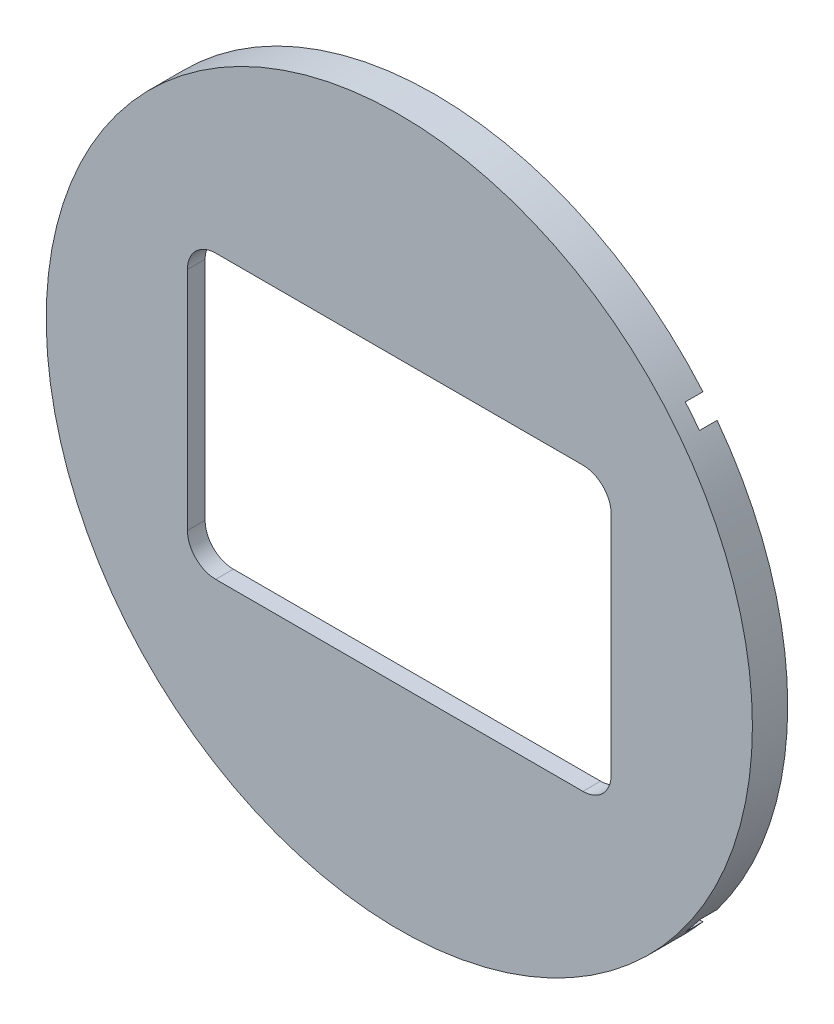
ISO-10303-21;
HEADER;
FILE_DESCRIPTION(('STEP AP214'),'2;1');
FILE_NAME('part.step','',(''),(''),'','','');
FILE_SCHEMA(('AUTOMOTIVE_DESIGN { 1 0 10303 214 1 1 1 1 }'));
ENDSEC;
DATA;
#1=APPLICATION_CONTEXT('core data for automotive mechanical design processes');
#2=APPLICATION_PROTOCOL_DEFINITION('international standard','automotive_design',2000,#1);
#3=PRODUCT_CONTEXT('',#1,'mechanical');
#4=PRODUCT('Part','Part','',(#3));
#5=PRODUCT_RELATED_PRODUCT_CATEGORY('part','',(#4));
#6=PRODUCT_DEFINITION_FORMATION('','',#4);
#7=PRODUCT_DEFINITION_CONTEXT('part definition',#1,'design');
#8=PRODUCT_DEFINITION('design','',#6,#7);
#9=PRODUCT_DEFINITION_SHAPE('','',#8);
#10=(LENGTH_UNIT() NAMED_UNIT(*) SI_UNIT(.MILLI.,.METRE.));
#11=(NAMED_UNIT(*) PLANE_ANGLE_UNIT() SI_UNIT($,.RADIAN.));
#12=(NAMED_UNIT(*) SI_UNIT($,.STERADIAN.) SOLID_ANGLE_UNIT());
#13=UNCERTAINTY_MEASURE_WITH_UNIT(LENGTH_MEASURE(1.E-05),#10,'distance_accuracy_value','');
#14=(GEOMETRIC_REPRESENTATION_CONTEXT(3) GLOBAL_UNCERTAINTY_ASSIGNED_CONTEXT((#13)) GLOBAL_UNIT_ASSIGNED_CONTEXT((#10,
#11,#12)) REPRESENTATION_CONTEXT('',''));
#15=CARTESIAN_POINT('',(0.,0.,0.));
#16=DIRECTION('',(0.,0.,1.));
#17=DIRECTION('',(1.,0.,0.));
#18=AXIS2_PLACEMENT_3D('',#15,#16,#17);
#19=CARTESIAN_POINT('',(0.,0.,-1.5875));
#20=DIRECTION('',(0.,0.,1.));
#21=DIRECTION('',(1.,0.,0.));
#22=AXIS2_PLACEMENT_3D('',#19,#20,#21);
#23=PLANE('',#22);
#24=CARTESIAN_POINT('',(0.,0.,-1.5875));
#25=DIRECTION('',(0.,0.,1.));
#26=DIRECTION('',(1.,0.,0.));
#27=AXIS2_PLACEMENT_3D('',#24,#25,#26);
#28=CIRCLE('',#27,31.75);
#29=CARTESIAN_POINT('',(-25.4,19.05,-1.5875));
#30=VERTEX_POINT('',#29);
#31=CARTESIAN_POINT('',(-25.4,-19.05,-1.5875));
#32=VERTEX_POINT('',#31);
#33=EDGE_CURVE('E170',#30,#32,#28,.T.);
#34=ORIENTED_EDGE('',*,*,#33,.F.);
#35=DIRECTION('',(0.,-1.,0.));
#36=VECTOR('',#35,1.);
#37=CARTESIAN_POINT('',(-25.4,0.,-1.5875));
#38=LINE('',#37,#36);
#39=EDGE_CURVE('E274',#30,#32,#38,.T.);
#40=ORIENTED_EDGE('',*,*,#39,.T.);
#41=EDGE_LOOP('',(#34,#40));
#42=FACE_BOUND('',#41,.T.);
#43=ADVANCED_FACE('F33',(#42),#23,.F.);
#44=CARTESIAN_POINT('',(-24.1279110937934,-20.6375,-1.5875));
#45=VERTEX_POINT('',#44);
#46=CARTESIAN_POINT('',(24.1279110937934,-20.6375,-1.5875));
#47=VERTEX_POINT('',#46);
#48=EDGE_CURVE('E176',#45,#47,#28,.T.);
#49=ORIENTED_EDGE('',*,*,#48,.F.);
#50=DIRECTION('',(1.,0.,0.));
#51=VECTOR('',#50,1.);
#52=CARTESIAN_POINT('',(0.,-20.6375,-1.5875));
#53=LINE('',#52,#51);
#54=EDGE_CURVE('E277',#45,#47,#53,.T.);
#55=ORIENTED_EDGE('',*,*,#54,.T.);
#56=EDGE_LOOP('',(#49,#55));
#57=FACE_BOUND('',#56,.T.);
#58=ADVANCED_FACE('F294',(#57),#23,.F.);
#59=CARTESIAN_POINT('',(25.4,-19.05,-1.5875));
#60=VERTEX_POINT('',#59);
#61=CARTESIAN_POINT('',(25.4,19.05,-1.5875));
#62=VERTEX_POINT('',#61);
#63=EDGE_CURVE('E172',#60,#62,#28,.T.);
#64=ORIENTED_EDGE('',*,*,#63,.F.);
#65=DIRECTION('',(0.,1.,0.));
#66=VECTOR('',#65,1.);
#67=CARTESIAN_POINT('',(25.4,0.,-1.5875));
#68=LINE('',#67,#66);
#69=EDGE_CURVE('E156',#60,#62,#68,.T.);
#70=ORIENTED_EDGE('',*,*,#69,.T.);
#71=EDGE_LOOP('',(#64,#70));
#72=FACE_BOUND('',#71,.T.);
#73=ADVANCED_FACE('F282',(#72),#23,.F.);
#74=CARTESIAN_POINT('',(0.,0.,1.5875));
#75=DIRECTION('',(0.,0.,-1.));
#76=DIRECTION('',(-1.,0.,0.));
#77=AXIS2_PLACEMENT_3D('',#74,#75,#76);
#78=CYLINDRICAL_SURFACE('',#77,31.75);
#79=ORIENTED_EDGE('',*,*,#63,.T.);
#80=DIRECTION('',(0.,0.,-1.));
#81=VECTOR('',#80,1.);
#82=CARTESIAN_POINT('',(25.4,19.05,1.5875));
#83=LINE('',#82,#81);
#84=CARTESIAN_POINT('',(25.4,19.05,0.));
#85=VERTEX_POINT('',#84);
#86=EDGE_CURVE('E167',#62,#85,#83,.F.);
#87=ORIENTED_EDGE('',*,*,#86,.T.);
#88=CARTESIAN_POINT('',(0.,0.,0.));
#89=DIRECTION('',(0.,0.,1.));
#90=DIRECTION('',(1.,0.,0.));
#91=AXIS2_PLACEMENT_3D('',#88,#89,#90);
#92=CIRCLE('',#91,31.75);
#93=CARTESIAN_POINT('',(24.1279110937934,20.6375,0.));
#94=VERTEX_POINT('',#93);
#95=EDGE_CURVE('E166',#85,#94,#92,.T.);
#96=ORIENTED_EDGE('',*,*,#95,.T.);
#97=DIRECTION('',(0.,0.,-1.));
#98=VECTOR('',#97,1.);
#99=CARTESIAN_POINT('',(24.1279110937934,20.6375,1.5875));
#100=LINE('',#99,#98);
#101=CARTESIAN_POINT('',(24.1279110937934,20.6375,-1.5875));
#102=VERTEX_POINT('',#101);
#103=EDGE_CURVE('E149',#94,#102,#100,.T.);
#104=ORIENTED_EDGE('',*,*,#103,.T.);
#105=CARTESIAN_POINT('',(-24.1279110937934,20.6375,-1.5875));
#106=VERTEX_POINT('',#105);
#107=EDGE_CURVE('E164',#102,#106,#28,.T.);
#108=ORIENTED_EDGE('',*,*,#107,.T.);
#109=DIRECTION('',(0.,0.,-1.));
#110=VECTOR('',#109,1.);
#111=CARTESIAN_POINT('',(-24.1279110937934,20.6375,1.5875));
#112=LINE('',#111,#110);
#113=CARTESIAN_POINT('',(-24.1279110937934,20.6375,0.));
#114=VERTEX_POINT('',#113);
#115=EDGE_CURVE('E152',#106,#114,#112,.F.);
#116=ORIENTED_EDGE('',*,*,#115,.T.);
#117=CARTESIAN_POINT('',(-25.4,19.05,0.));
#118=VERTEX_POINT('',#117);
#119=EDGE_CURVE('E366',#114,#118,#92,.T.);
#120=ORIENTED_EDGE('',*,*,#119,.T.);
#121=DIRECTION('',(0.,0.,-1.));
#122=VECTOR('',#121,1.);
#123=CARTESIAN_POINT('',(-25.4,19.05,1.5875));
#124=LINE('',#123,#122);
#125=EDGE_CURVE('E177',#118,#30,#124,.T.);
#126=ORIENTED_EDGE('',*,*,#125,.T.);
#127=ORIENTED_EDGE('',*,*,#33,.T.);
#128=DIRECTION('',(0.,0.,-1.));
#129=VECTOR('',#128,1.);
#130=CARTESIAN_POINT('',(-25.4,-19.05,1.5875));
#131=LINE('',#130,#129);
#132=CARTESIAN_POINT('',(-25.4,-19.05,0.));
#133=VERTEX_POINT('',#132);
#134=EDGE_CURVE('E182',#32,#133,#131,.F.);
#135=ORIENTED_EDGE('',*,*,#134,.T.);
#136=CARTESIAN_POINT('',(-24.1279110937934,-20.6375,0.));
#137=VERTEX_POINT('',#136);
#138=EDGE_CURVE('E273',#133,#137,#92,.T.);
#139=ORIENTED_EDGE('',*,*,#138,.T.);
#140=DIRECTION('',(0.,0.,-1.));
#141=VECTOR('',#140,1.);
#142=CARTESIAN_POINT('',(-24.1279110937934,-20.6375,1.5875));
#143=LINE('',#142,#141);
#144=EDGE_CURVE('E187',#137,#45,#143,.T.);
#145=ORIENTED_EDGE('',*,*,#144,.T.);
#146=ORIENTED_EDGE('',*,*,#48,.T.);
#147=DIRECTION('',(0.,0.,-1.));
#148=VECTOR('',#147,1.);
#149=CARTESIAN_POINT('',(24.1279110937934,-20.6375,1.5875));
#150=LINE('',#149,#148);
#151=CARTESIAN_POINT('',(24.1279110937934,-20.6375,0.));
#152=VERTEX_POINT('',#151);
#153=EDGE_CURVE('E192',#47,#152,#150,.F.);
#154=ORIENTED_EDGE('',*,*,#153,.T.);
#155=CARTESIAN_POINT('',(25.4,-19.05,0.));
#156=VERTEX_POINT('',#155);
#157=EDGE_CURVE('E270',#152,#156,#92,.T.);
#158=ORIENTED_EDGE('',*,*,#157,.T.);
#159=DIRECTION('',(0.,0.,-1.));
#160=VECTOR('',#159,1.);
#161=CARTESIAN_POINT('',(25.4,-19.05,1.5875));
#162=LINE('',#161,#160);
#163=EDGE_CURVE('E195',#156,#60,#162,.T.);
#164=ORIENTED_EDGE('',*,*,#163,.T.);
#165=EDGE_LOOP('',(#79,#87,#96,#104,#108,#116,#120,#126,#127,#135,#139,#145,#146,#154,#158,#164));
#166=FACE_BOUND('',#165,.T.);
#167=CARTESIAN_POINT('',(0.,0.,1.5875));
#168=DIRECTION('',(0.,0.,1.));
#169=DIRECTION('',(1.,0.,0.));
#170=AXIS2_PLACEMENT_3D('',#167,#168,#169);
#171=CIRCLE('',#170,31.75);
#172=CARTESIAN_POINT('',(31.75,0.,1.5875));
#173=VERTEX_POINT('',#172);
#174=EDGE_CURVE('E157',#173,#173,#171,.T.);
#175=ORIENTED_EDGE('',*,*,#174,.F.);
#176=EDGE_LOOP('',(#175));
#177=FACE_BOUND('',#176,.T.);
#178=ADVANCED_FACE('F162',(#166,#177),#78,.T.);
#179=CARTESIAN_POINT('',(0.,0.,1.5875));
#180=DIRECTION('',(0.,0.,1.));
#181=DIRECTION('',(1.,0.,0.));
#182=AXIS2_PLACEMENT_3D('',#179,#180,#181);
#183=PLANE('',#182);
#184=DIRECTION('',(-1.,0.,0.));
#185=VECTOR('',#184,1.);
#186=CARTESIAN_POINT('',(19.05,-12.7,1.5875));
#187=LINE('',#186,#185);
#188=CARTESIAN_POINT('',(16.51,-12.7,1.5875));
#189=VERTEX_POINT('',#188);
#190=CARTESIAN_POINT('',(-16.51,-12.7,1.5875));
#191=VERTEX_POINT('',#190);
#192=EDGE_CURVE('E226',#189,#191,#187,.T.);
#193=ORIENTED_EDGE('',*,*,#192,.T.);
#194=CARTESIAN_POINT('',(-16.51,-10.16,1.5875));
#195=DIRECTION('',(0.,0.,1.));
#196=DIRECTION('',(1.,0.,0.));
#197=AXIS2_PLACEMENT_3D('',#194,#195,#196);
#198=CIRCLE('',#197,2.54);
#199=CARTESIAN_POINT('',(-19.05,-10.16,1.5875));
#200=VERTEX_POINT('',#199);
#201=EDGE_CURVE('E250',#191,#200,#198,.F.);
#202=ORIENTED_EDGE('',*,*,#201,.T.);
#203=DIRECTION('',(0.,1.,0.));
#204=VECTOR('',#203,1.);
#205=CARTESIAN_POINT('',(-19.05,-12.7,1.5875));
#206=LINE('',#205,#204);
#207=CARTESIAN_POINT('',(-19.05,10.16,1.5875));
#208=VERTEX_POINT('',#207);
#209=EDGE_CURVE('E223',#200,#208,#206,.T.);
#210=ORIENTED_EDGE('',*,*,#209,.T.);
#211=CARTESIAN_POINT('',(-16.51,10.16,1.5875));
#212=DIRECTION('',(0.,0.,1.));
#213=DIRECTION('',(1.,0.,0.));
#214=AXIS2_PLACEMENT_3D('',#211,#212,#213);
#215=CIRCLE('',#214,2.54);
#216=CARTESIAN_POINT('',(-16.51,12.7,1.5875));
#217=VERTEX_POINT('',#216);
#218=EDGE_CURVE('E244',#208,#217,#215,.F.);
#219=ORIENTED_EDGE('',*,*,#218,.T.);
#220=DIRECTION('',(1.,0.,0.));
#221=VECTOR('',#220,1.);
#222=CARTESIAN_POINT('',(19.05,12.7,1.5875));
#223=LINE('',#222,#221);
#224=CARTESIAN_POINT('',(16.51,12.7,1.5875));
#225=VERTEX_POINT('',#224);
#226=EDGE_CURVE('E210',#217,#225,#223,.T.);
#227=ORIENTED_EDGE('',*,*,#226,.T.);
#228=CARTESIAN_POINT('',(16.51,10.16,1.5875));
#229=DIRECTION('',(0.,0.,1.));
#230=DIRECTION('',(1.,0.,0.));
#231=AXIS2_PLACEMENT_3D('',#228,#229,#230);
#232=CIRCLE('',#231,2.54);
#233=CARTESIAN_POINT('',(19.05,10.16,1.5875));
#234=VERTEX_POINT('',#233);
#235=EDGE_CURVE('E11',#225,#234,#232,.F.);
#236=ORIENTED_EDGE('',*,*,#235,.T.);
#237=DIRECTION('',(0.,-1.,0.));
#238=VECTOR('',#237,1.);
#239=CARTESIAN_POINT('',(19.05,-12.7,1.5875));
#240=LINE('',#239,#238);
#241=CARTESIAN_POINT('',(19.05,-10.16,1.5875));
#242=VERTEX_POINT('',#241);
#243=EDGE_CURVE('E229',#234,#242,#240,.T.);
#244=ORIENTED_EDGE('',*,*,#243,.T.);
#245=CARTESIAN_POINT('',(16.51,-10.16,1.5875));
#246=DIRECTION('',(0.,0.,1.));
#247=DIRECTION('',(1.,0.,0.));
#248=AXIS2_PLACEMENT_3D('',#245,#246,#247);
#249=CIRCLE('',#248,2.54);
#250=EDGE_CURVE('E233',#242,#189,#249,.F.);
#251=ORIENTED_EDGE('',*,*,#250,.T.);
#252=EDGE_LOOP('',(#193,#202,#210,#219,#227,#236,#244,#251));
#253=FACE_BOUND('',#252,.T.);
#254=ORIENTED_EDGE('',*,*,#174,.T.);
#255=EDGE_LOOP('',(#254));
#256=FACE_BOUND('',#255,.T.);
#257=ADVANCED_FACE('F231',(#253,#256),#183,.T.);
#258=ORIENTED_EDGE('',*,*,#107,.F.);
#259=DIRECTION('',(-1.,0.,0.));
#260=VECTOR('',#259,1.);
#261=CARTESIAN_POINT('',(0.,20.6375,-1.5875));
#262=LINE('',#261,#260);
#263=EDGE_CURVE('E145',#102,#106,#262,.T.);
#264=ORIENTED_EDGE('',*,*,#263,.T.);
#265=EDGE_LOOP('',(#258,#264));
#266=FACE_BOUND('',#265,.T.);
#267=ADVANCED_FACE('F169',(#266),#23,.F.);
#268=CARTESIAN_POINT('',(0.,0.,0.));
#269=DIRECTION('',(0.,0.,1.));
#270=DIRECTION('',(1.,0.,0.));
#271=AXIS2_PLACEMENT_3D('',#268,#269,#270);
#272=PLANE('',#271);
#273=DIRECTION('',(1.,0.,0.));
#274=VECTOR('',#273,1.);
#275=CARTESIAN_POINT('',(19.05,12.7,0.));
#276=LINE('',#275,#274);
#277=CARTESIAN_POINT('',(-16.51,12.7,0.));
#278=VERTEX_POINT('',#277);
#279=CARTESIAN_POINT('',(16.51,12.7,0.));
#280=VERTEX_POINT('',#279);
#281=EDGE_CURVE('E217',#278,#280,#276,.T.);
#282=ORIENTED_EDGE('',*,*,#281,.F.);
#283=CARTESIAN_POINT('',(-16.51,10.16,0.));
#284=DIRECTION('',(0.,0.,1.));
#285=DIRECTION('',(1.,0.,0.));
#286=AXIS2_PLACEMENT_3D('',#283,#284,#285);
#287=CIRCLE('',#286,2.54);
#288=CARTESIAN_POINT('',(-19.05,10.16,0.));
#289=VERTEX_POINT('',#288);
#290=EDGE_CURVE('E248',#278,#289,#287,.T.);
#291=ORIENTED_EDGE('',*,*,#290,.T.);
#292=DIRECTION('',(0.,1.,0.));
#293=VECTOR('',#292,1.);
#294=CARTESIAN_POINT('',(-19.05,-12.7,0.));
#295=LINE('',#294,#293);
#296=CARTESIAN_POINT('',(-19.05,-10.16,0.));
#297=VERTEX_POINT('',#296);
#298=EDGE_CURVE('E220',#297,#289,#295,.T.);
#299=ORIENTED_EDGE('',*,*,#298,.F.);
#300=CARTESIAN_POINT('',(-16.51,-10.16,0.));
#301=DIRECTION('',(0.,0.,1.));
#302=DIRECTION('',(1.,0.,0.));
#303=AXIS2_PLACEMENT_3D('',#300,#301,#302);
#304=CIRCLE('',#303,2.54);
#305=CARTESIAN_POINT('',(-16.51,-12.7,0.));
#306=VERTEX_POINT('',#305);
#307=EDGE_CURVE('E252',#297,#306,#304,.T.);
#308=ORIENTED_EDGE('',*,*,#307,.T.);
#309=DIRECTION('',(-1.,0.,0.));
#310=VECTOR('',#309,1.);
#311=CARTESIAN_POINT('',(19.05,-12.7,0.));
#312=LINE('',#311,#310);
#313=CARTESIAN_POINT('',(16.51,-12.7,0.));
#314=VERTEX_POINT('',#313);
#315=EDGE_CURVE('E212',#314,#306,#312,.T.);
#316=ORIENTED_EDGE('',*,*,#315,.F.);
#317=CARTESIAN_POINT('',(16.51,-10.16,0.));
#318=DIRECTION('',(0.,0.,1.));
#319=DIRECTION('',(1.,0.,0.));
#320=AXIS2_PLACEMENT_3D('',#317,#318,#319);
#321=CIRCLE('',#320,2.54);
#322=CARTESIAN_POINT('',(19.05,-10.16,0.));
#323=VERTEX_POINT('',#322);
#324=EDGE_CURVE('E242',#314,#323,#321,.T.);
#325=ORIENTED_EDGE('',*,*,#324,.T.);
#326=DIRECTION('',(0.,-1.,0.));
#327=VECTOR('',#326,1.);
#328=CARTESIAN_POINT('',(19.05,-12.7,0.));
#329=LINE('',#328,#327);
#330=CARTESIAN_POINT('',(19.05,10.16,0.));
#331=VERTEX_POINT('',#330);
#332=EDGE_CURVE('E215',#331,#323,#329,.T.);
#333=ORIENTED_EDGE('',*,*,#332,.F.);
#334=CARTESIAN_POINT('',(16.51,10.16,0.));
#335=DIRECTION('',(0.,0.,1.));
#336=DIRECTION('',(1.,0.,0.));
#337=AXIS2_PLACEMENT_3D('',#334,#335,#336);
#338=CIRCLE('',#337,2.54);
#339=EDGE_CURVE('E41',#331,#280,#338,.T.);
#340=ORIENTED_EDGE('',*,*,#339,.T.);
#341=EDGE_LOOP('',(#282,#291,#299,#308,#316,#325,#333,#340));
#342=FACE_BOUND('',#341,.T.);
#343=DIRECTION('',(0.,-1.,0.));
#344=VECTOR('',#343,1.);
#345=CARTESIAN_POINT('',(25.4,-20.6375,0.));
#346=LINE('',#345,#344);
#347=EDGE_CURVE('E202',#85,#156,#346,.T.);
#348=ORIENTED_EDGE('',*,*,#347,.T.);
#349=ORIENTED_EDGE('',*,*,#157,.F.);
#350=DIRECTION('',(-1.,0.,0.));
#351=VECTOR('',#350,1.);
#352=CARTESIAN_POINT('',(25.4,-20.6375,0.));
#353=LINE('',#352,#351);
#354=EDGE_CURVE('E199',#152,#137,#353,.T.);
#355=ORIENTED_EDGE('',*,*,#354,.T.);
#356=ORIENTED_EDGE('',*,*,#138,.F.);
#357=DIRECTION('',(0.,1.,0.));
#358=VECTOR('',#357,1.);
#359=CARTESIAN_POINT('',(-25.4,-20.6375,0.));
#360=LINE('',#359,#358);
#361=EDGE_CURVE('E207',#133,#118,#360,.T.);
#362=ORIENTED_EDGE('',*,*,#361,.T.);
#363=ORIENTED_EDGE('',*,*,#119,.F.);
#364=DIRECTION('',(1.,0.,0.));
#365=VECTOR('',#364,1.);
#366=CARTESIAN_POINT('',(25.4,20.6375,0.));
#367=LINE('',#366,#365);
#368=EDGE_CURVE('E205',#114,#94,#367,.T.);
#369=ORIENTED_EDGE('',*,*,#368,.T.);
#370=ORIENTED_EDGE('',*,*,#95,.F.);
#371=EDGE_LOOP('',(#348,#349,#355,#356,#362,#363,#369,#370));
#372=FACE_BOUND('',#371,.T.);
#373=ADVANCED_FACE('F288',(#342,#372),#272,.F.);
#374=CARTESIAN_POINT('',(-25.4,-20.6375,0.));
#375=DIRECTION('',(-1.,0.,0.));
#376=DIRECTION('',(0.,0.,1.));
#377=AXIS2_PLACEMENT_3D('',#374,#375,#376);
#378=PLANE('',#377);
#379=ORIENTED_EDGE('',*,*,#361,.F.);
#380=ORIENTED_EDGE('',*,*,#134,.F.);
#381=ORIENTED_EDGE('',*,*,#39,.F.);
#382=ORIENTED_EDGE('',*,*,#125,.F.);
#383=EDGE_LOOP('',(#379,#380,#381,#382));
#384=FACE_BOUND('',#383,.T.);
#385=ADVANCED_FACE('F355',(#384),#378,.F.);
#386=CARTESIAN_POINT('',(25.4,-20.6375,0.));
#387=DIRECTION('',(0.,-1.,0.));
#388=DIRECTION('',(0.,0.,-1.));
#389=AXIS2_PLACEMENT_3D('',#386,#387,#388);
#390=PLANE('',#389);
#391=ORIENTED_EDGE('',*,*,#354,.F.);
#392=ORIENTED_EDGE('',*,*,#153,.F.);
#393=ORIENTED_EDGE('',*,*,#54,.F.);
#394=ORIENTED_EDGE('',*,*,#144,.F.);
#395=EDGE_LOOP('',(#391,#392,#393,#394));
#396=FACE_BOUND('',#395,.T.);
#397=ADVANCED_FACE('F291',(#396),#390,.F.);
#398=CARTESIAN_POINT('',(25.4,-20.6375,0.));
#399=DIRECTION('',(1.,0.,0.));
#400=DIRECTION('',(0.,0.,-1.));
#401=AXIS2_PLACEMENT_3D('',#398,#399,#400);
#402=PLANE('',#401);
#403=ORIENTED_EDGE('',*,*,#347,.F.);
#404=ORIENTED_EDGE('',*,*,#86,.F.);
#405=ORIENTED_EDGE('',*,*,#69,.F.);
#406=ORIENTED_EDGE('',*,*,#163,.F.);
#407=EDGE_LOOP('',(#403,#404,#405,#406));
#408=FACE_BOUND('',#407,.T.);
#409=ADVANCED_FACE('F285',(#408),#402,.F.);
#410=CARTESIAN_POINT('',(25.4,20.6375,0.));
#411=DIRECTION('',(0.,1.,0.));
#412=DIRECTION('',(0.,0.,1.));
#413=AXIS2_PLACEMENT_3D('',#410,#411,#412);
#414=PLANE('',#413);
#415=ORIENTED_EDGE('',*,*,#368,.F.);
#416=ORIENTED_EDGE('',*,*,#115,.F.);
#417=ORIENTED_EDGE('',*,*,#263,.F.);
#418=ORIENTED_EDGE('',*,*,#103,.F.);
#419=EDGE_LOOP('',(#415,#416,#417,#418));
#420=FACE_BOUND('',#419,.T.);
#421=ADVANCED_FACE('F148',(#420),#414,.F.);
#422=CARTESIAN_POINT('',(-19.05,-12.7,1.5885));
#423=DIRECTION('',(-1.,0.,0.));
#424=DIRECTION('',(0.,0.,1.));
#425=AXIS2_PLACEMENT_3D('',#422,#423,#424);
#426=PLANE('',#425);
#427=ORIENTED_EDGE('',*,*,#209,.F.);
#428=DIRECTION('',(0.,0.,-1.));
#429=VECTOR('',#428,1.);
#430=CARTESIAN_POINT('',(-19.05,-10.16,0.));
#431=LINE('',#430,#429);
#432=EDGE_CURVE('E265',#200,#297,#431,.T.);
#433=ORIENTED_EDGE('',*,*,#432,.T.);
#434=ORIENTED_EDGE('',*,*,#298,.T.);
#435=DIRECTION('',(0.,0.,-1.));
#436=VECTOR('',#435,1.);
#437=CARTESIAN_POINT('',(-19.05,10.16,1.5875));
#438=LINE('',#437,#436);
#439=EDGE_CURVE('E268',#289,#208,#438,.F.);
#440=ORIENTED_EDGE('',*,*,#439,.T.);
#441=EDGE_LOOP('',(#427,#433,#434,#440));
#442=FACE_BOUND('',#441,.T.);
#443=ADVANCED_FACE('F337',(#442),#426,.F.);
#444=CARTESIAN_POINT('',(19.05,-12.7,1.5885));
#445=DIRECTION('',(0.,-1.,0.));
#446=DIRECTION('',(0.,0.,-1.));
#447=AXIS2_PLACEMENT_3D('',#444,#445,#446);
#448=PLANE('',#447);
#449=ORIENTED_EDGE('',*,*,#315,.T.);
#450=DIRECTION('',(0.,0.,-1.));
#451=VECTOR('',#450,1.);
#452=CARTESIAN_POINT('',(-16.51,-12.7,1.5875));
#453=LINE('',#452,#451);
#454=EDGE_CURVE('E262',#306,#191,#453,.F.);
#455=ORIENTED_EDGE('',*,*,#454,.T.);
#456=ORIENTED_EDGE('',*,*,#192,.F.);
#457=DIRECTION('',(0.,0.,-1.));
#458=VECTOR('',#457,1.);
#459=CARTESIAN_POINT('',(16.51,-12.7,0.));
#460=LINE('',#459,#458);
#461=EDGE_CURVE('E241',#189,#314,#460,.T.);
#462=ORIENTED_EDGE('',*,*,#461,.T.);
#463=EDGE_LOOP('',(#449,#455,#456,#462));
#464=FACE_BOUND('',#463,.T.);
#465=ADVANCED_FACE('F330',(#464),#448,.F.);
#466=CARTESIAN_POINT('',(19.05,-12.7,1.5885));
#467=DIRECTION('',(1.,0.,0.));
#468=DIRECTION('',(0.,0.,-1.));
#469=AXIS2_PLACEMENT_3D('',#466,#467,#468);
#470=PLANE('',#469);
#471=ORIENTED_EDGE('',*,*,#332,.T.);
#472=DIRECTION('',(0.,0.,-1.));
#473=VECTOR('',#472,1.);
#474=CARTESIAN_POINT('',(19.05,-10.16,1.5875));
#475=LINE('',#474,#473);
#476=EDGE_CURVE('E48',#323,#242,#475,.F.);
#477=ORIENTED_EDGE('',*,*,#476,.T.);
#478=ORIENTED_EDGE('',*,*,#243,.F.);
#479=DIRECTION('',(0.,0.,-1.));
#480=VECTOR('',#479,1.);
#481=CARTESIAN_POINT('',(19.05,10.16,0.));
#482=LINE('',#481,#480);
#483=EDGE_CURVE('E255',#234,#331,#482,.T.);
#484=ORIENTED_EDGE('',*,*,#483,.T.);
#485=EDGE_LOOP('',(#471,#477,#478,#484));
#486=FACE_BOUND('',#485,.T.);
#487=ADVANCED_FACE('F325',(#486),#470,.F.);
#488=CARTESIAN_POINT('',(19.05,12.7,1.5885));
#489=DIRECTION('',(0.,1.,0.));
#490=DIRECTION('',(0.,0.,1.));
#491=AXIS2_PLACEMENT_3D('',#488,#489,#490);
#492=PLANE('',#491);
#493=ORIENTED_EDGE('',*,*,#226,.F.);
#494=DIRECTION('',(0.,0.,-1.));
#495=VECTOR('',#494,1.);
#496=CARTESIAN_POINT('',(-16.51,12.7,0.));
#497=LINE('',#496,#495);
#498=EDGE_CURVE('E257',#217,#278,#497,.T.);
#499=ORIENTED_EDGE('',*,*,#498,.T.);
#500=ORIENTED_EDGE('',*,*,#281,.T.);
#501=DIRECTION('',(0.,0.,-1.));
#502=VECTOR('',#501,1.);
#503=CARTESIAN_POINT('',(16.51,12.7,1.5875));
#504=LINE('',#503,#502);
#505=EDGE_CURVE('E260',#280,#225,#504,.F.);
#506=ORIENTED_EDGE('',*,*,#505,.T.);
#507=EDGE_LOOP('',(#493,#499,#500,#506));
#508=FACE_BOUND('',#507,.T.);
#509=ADVANCED_FACE('F312',(#508),#492,.F.);
#510=CARTESIAN_POINT('',(-16.51,-10.16,1.5885));
#511=DIRECTION('',(0.,0.,1.));
#512=DIRECTION('',(1.,0.,0.));
#513=AXIS2_PLACEMENT_3D('',#510,#511,#512);
#514=CYLINDRICAL_SURFACE('',#513,2.54);
#515=ORIENTED_EDGE('',*,*,#201,.F.);
#516=ORIENTED_EDGE('',*,*,#454,.F.);
#517=ORIENTED_EDGE('',*,*,#307,.F.);
#518=ORIENTED_EDGE('',*,*,#432,.F.);
#519=EDGE_LOOP('',(#515,#516,#517,#518));
#520=FACE_BOUND('',#519,.T.);
#521=ADVANCED_FACE('F308',(#520),#514,.F.);
#522=CARTESIAN_POINT('',(-16.51,10.16,1.5885));
#523=DIRECTION('',(0.,0.,1.));
#524=DIRECTION('',(1.,0.,0.));
#525=AXIS2_PLACEMENT_3D('',#522,#523,#524);
#526=CYLINDRICAL_SURFACE('',#525,2.54);
#527=ORIENTED_EDGE('',*,*,#218,.F.);
#528=ORIENTED_EDGE('',*,*,#439,.F.);
#529=ORIENTED_EDGE('',*,*,#290,.F.);
#530=ORIENTED_EDGE('',*,*,#498,.F.);
#531=EDGE_LOOP('',(#527,#528,#529,#530));
#532=FACE_BOUND('',#531,.T.);
#533=ADVANCED_FACE('F311',(#532),#526,.F.);
#534=CARTESIAN_POINT('',(16.51,-10.16,1.5885));
#535=DIRECTION('',(0.,0.,1.));
#536=DIRECTION('',(1.,0.,0.));
#537=AXIS2_PLACEMENT_3D('',#534,#535,#536);
#538=CYLINDRICAL_SURFACE('',#537,2.54);
#539=ORIENTED_EDGE('',*,*,#250,.F.);
#540=ORIENTED_EDGE('',*,*,#476,.F.);
#541=ORIENTED_EDGE('',*,*,#324,.F.);
#542=ORIENTED_EDGE('',*,*,#461,.F.);
#543=EDGE_LOOP('',(#539,#540,#541,#542));
#544=FACE_BOUND('',#543,.T.);
#545=ADVANCED_FACE('F239',(#544),#538,.F.);
#546=CARTESIAN_POINT('',(16.51,10.16,1.5885));
#547=DIRECTION('',(0.,0.,1.));
#548=DIRECTION('',(1.,0.,0.));
#549=AXIS2_PLACEMENT_3D('',#546,#547,#548);
#550=CYLINDRICAL_SURFACE('',#549,2.54);
#551=ORIENTED_EDGE('',*,*,#235,.F.);
#552=ORIENTED_EDGE('',*,*,#505,.F.);
#553=ORIENTED_EDGE('',*,*,#339,.F.);
#554=ORIENTED_EDGE('',*,*,#483,.F.);
#555=EDGE_LOOP('',(#551,#552,#553,#554));
#556=FACE_BOUND('',#555,.T.);
#557=ADVANCED_FACE('F35',(#556),#550,.F.);
#558=CLOSED_SHELL('',(#43,#58,#73,#178,#257,#267,#373,#385,#397,#409,#421,#443,#465,#487,#509,
#521,#533,#545,#557));
#559=MANIFOLD_SOLID_BREP('B2',#558);
#560=ADVANCED_BREP_SHAPE_REPRESENTATION('',(#18,#559),#14);
#561=SHAPE_DEFINITION_REPRESENTATION(#9,#560);
ENDSEC;
END-ISO-10303-21;
